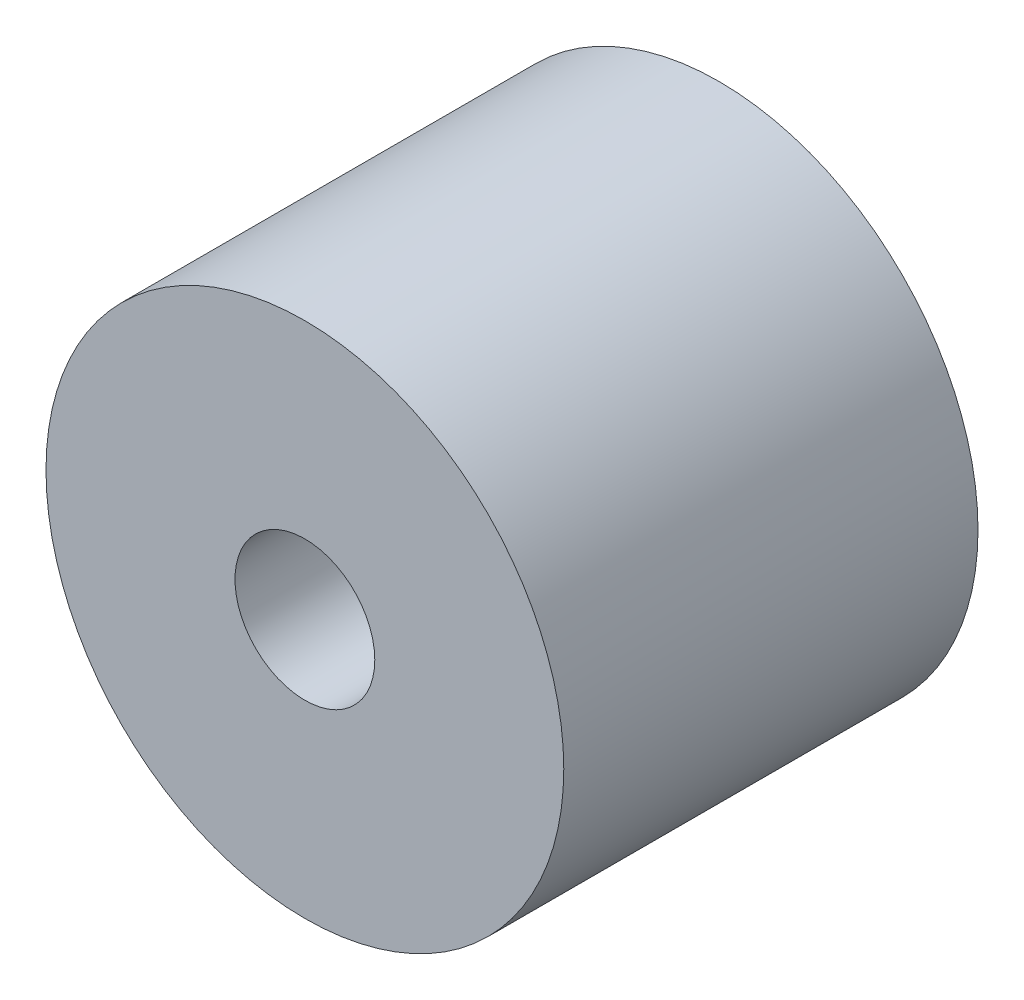
ISO-10303-21;
HEADER;
FILE_DESCRIPTION(('STEP AP214'),'2;1');
FILE_NAME('part.step','',(''),(''),'','','');
FILE_SCHEMA(('AUTOMOTIVE_DESIGN { 1 0 10303 214 1 1 1 1 }'));
ENDSEC;
DATA;
#1=APPLICATION_CONTEXT('core data for automotive mechanical design processes');
#2=APPLICATION_PROTOCOL_DEFINITION('international standard','automotive_design',2000,#1);
#3=PRODUCT_CONTEXT('',#1,'mechanical');
#4=PRODUCT('Part','Part','',(#3));
#5=PRODUCT_RELATED_PRODUCT_CATEGORY('part','',(#4));
#6=PRODUCT_DEFINITION_FORMATION('','',#4);
#7=PRODUCT_DEFINITION_CONTEXT('part definition',#1,'design');
#8=PRODUCT_DEFINITION('design','',#6,#7);
#9=PRODUCT_DEFINITION_SHAPE('','',#8);
#10=(LENGTH_UNIT() NAMED_UNIT(*) SI_UNIT(.MILLI.,.METRE.));
#11=(NAMED_UNIT(*) PLANE_ANGLE_UNIT() SI_UNIT($,.RADIAN.));
#12=(NAMED_UNIT(*) SI_UNIT($,.STERADIAN.) SOLID_ANGLE_UNIT());
#13=UNCERTAINTY_MEASURE_WITH_UNIT(LENGTH_MEASURE(1.E-05),#10,'distance_accuracy_value','');
#14=(GEOMETRIC_REPRESENTATION_CONTEXT(3) GLOBAL_UNCERTAINTY_ASSIGNED_CONTEXT((#13)) GLOBAL_UNIT_ASSIGNED_CONTEXT((#10,
#11,#12)) REPRESENTATION_CONTEXT('',''));
#15=CARTESIAN_POINT('',(0.,0.,0.));
#16=DIRECTION('',(0.,0.,1.));
#17=DIRECTION('',(1.,0.,0.));
#18=AXIS2_PLACEMENT_3D('',#15,#16,#17);
#19=CARTESIAN_POINT('',(0.,0.,-10.16));
#20=DIRECTION('',(0.,0.,1.));
#21=DIRECTION('',(1.,0.,0.));
#22=AXIS2_PLACEMENT_3D('',#19,#20,#21);
#23=CYLINDRICAL_SURFACE('',#22,6.35);
#24=CARTESIAN_POINT('',(0.,0.,-10.16));
#25=DIRECTION('',(0.,0.,1.));
#26=DIRECTION('',(1.,0.,0.));
#27=AXIS2_PLACEMENT_3D('',#24,#25,#26);
#28=CIRCLE('',#27,6.35);
#29=CARTESIAN_POINT('',(6.35,0.,-10.16));
#30=VERTEX_POINT('',#29);
#31=EDGE_CURVE('E10',#30,#30,#28,.T.);
#32=ORIENTED_EDGE('',*,*,#31,.T.);
#33=EDGE_LOOP('',(#32));
#34=FACE_BOUND('',#33,.T.);
#35=CARTESIAN_POINT('',(0.,0.,0.));
#36=DIRECTION('',(0.,0.,1.));
#37=DIRECTION('',(1.,0.,0.));
#38=AXIS2_PLACEMENT_3D('',#35,#36,#37);
#39=CIRCLE('',#38,6.35);
#40=CARTESIAN_POINT('',(6.35,0.,0.));
#41=VERTEX_POINT('',#40);
#42=EDGE_CURVE('E40',#41,#41,#39,.T.);
#43=ORIENTED_EDGE('',*,*,#42,.F.);
#44=EDGE_LOOP('',(#43));
#45=FACE_BOUND('',#44,.T.);
#46=ADVANCED_FACE('F37',(#34,#45),#23,.T.);
#47=CARTESIAN_POINT('',(0.,0.,-10.16));
#48=DIRECTION('',(0.,0.,1.));
#49=DIRECTION('',(1.,0.,0.));
#50=AXIS2_PLACEMENT_3D('',#47,#48,#49);
#51=PLANE('',#50);
#52=CARTESIAN_POINT('',(0.,0.,-10.16));
#53=DIRECTION('',(0.,0.,1.));
#54=DIRECTION('',(1.,0.,0.));
#55=AXIS2_PLACEMENT_3D('',#52,#53,#54);
#56=CIRCLE('',#55,1.7145);
#57=CARTESIAN_POINT('',(1.7145,0.,-10.16));
#58=VERTEX_POINT('',#57);
#59=EDGE_CURVE('E49',#58,#58,#56,.T.);
#60=ORIENTED_EDGE('',*,*,#59,.T.);
#61=EDGE_LOOP('',(#60));
#62=FACE_BOUND('',#61,.T.);
#63=ORIENTED_EDGE('',*,*,#31,.F.);
#64=EDGE_LOOP('',(#63));
#65=FACE_BOUND('',#64,.T.);
#66=ADVANCED_FACE('F59',(#62,#65),#51,.F.);
#67=CARTESIAN_POINT('',(0.,0.,0.));
#68=DIRECTION('',(0.,0.,1.));
#69=DIRECTION('',(1.,0.,0.));
#70=AXIS2_PLACEMENT_3D('',#67,#68,#69);
#71=PLANE('',#70);
#72=CARTESIAN_POINT('',(0.,0.,0.));
#73=DIRECTION('',(0.,0.,1.));
#74=DIRECTION('',(1.,0.,0.));
#75=AXIS2_PLACEMENT_3D('',#72,#73,#74);
#76=CIRCLE('',#75,1.7145);
#77=CARTESIAN_POINT('',(1.7145,0.,0.));
#78=VERTEX_POINT('',#77);
#79=EDGE_CURVE('E51',#78,#78,#76,.T.);
#80=ORIENTED_EDGE('',*,*,#79,.F.);
#81=EDGE_LOOP('',(#80));
#82=FACE_BOUND('',#81,.T.);
#83=ORIENTED_EDGE('',*,*,#42,.T.);
#84=EDGE_LOOP('',(#83));
#85=FACE_BOUND('',#84,.T.);
#86=ADVANCED_FACE('F65',(#82,#85),#71,.T.);
#87=CARTESIAN_POINT('',(0.,0.,-10.16));
#88=DIRECTION('',(0.,0.,1.));
#89=DIRECTION('',(1.,0.,0.));
#90=AXIS2_PLACEMENT_3D('',#87,#88,#89);
#91=CYLINDRICAL_SURFACE('',#90,1.7145);
#92=ORIENTED_EDGE('',*,*,#59,.F.);
#93=EDGE_LOOP('',(#92));
#94=FACE_BOUND('',#93,.T.);
#95=ORIENTED_EDGE('',*,*,#79,.T.);
#96=EDGE_LOOP('',(#95));
#97=FACE_BOUND('',#96,.T.);
#98=ADVANCED_FACE('F62',(#94,#97),#91,.F.);
#99=CLOSED_SHELL('',(#46,#66,#86,#98));
#100=MANIFOLD_SOLID_BREP('B2',#99);
#101=ADVANCED_BREP_SHAPE_REPRESENTATION('',(#18,#100),#14);
#102=SHAPE_DEFINITION_REPRESENTATION(#9,#101);
ENDSEC;
END-ISO-10303-21;
